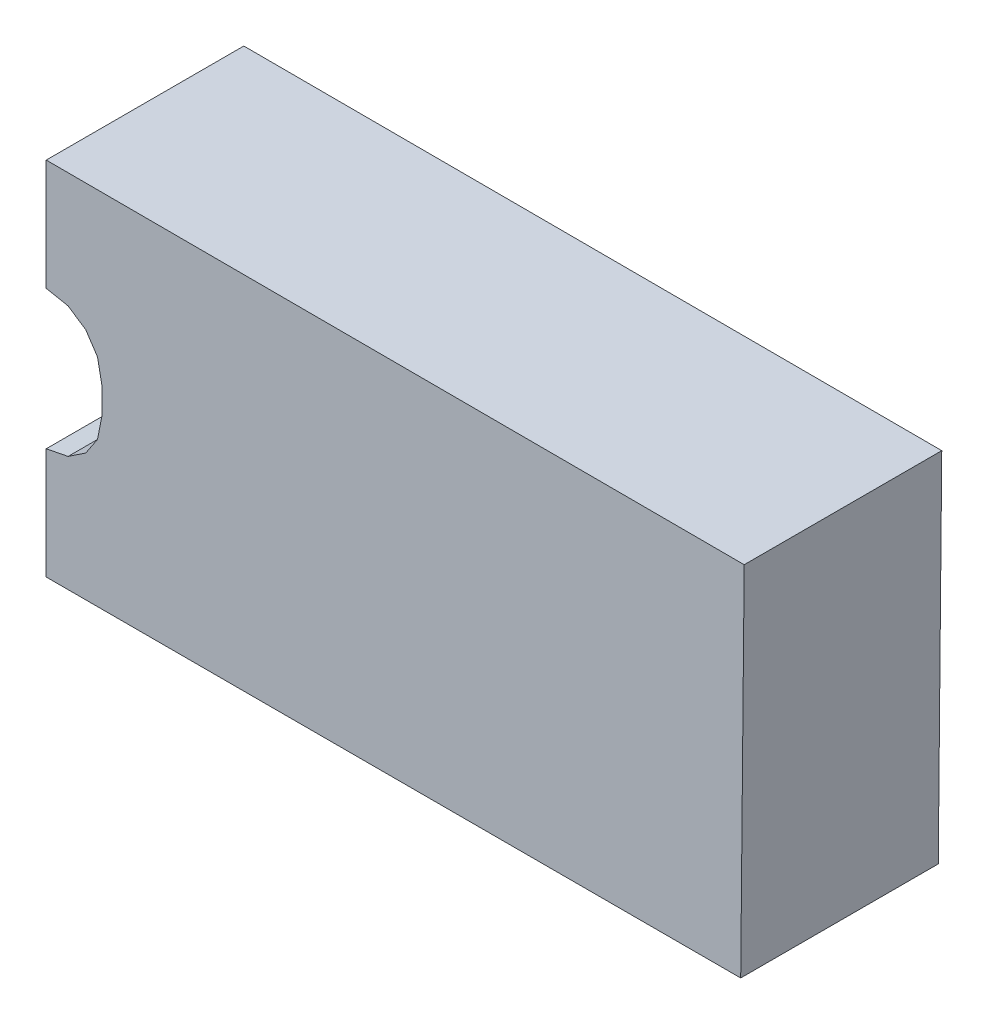
ISO-10303-21;
HEADER;
FILE_DESCRIPTION(('STEP AP214'),'2;1');
FILE_NAME('part.step','',(''),(''),'','','');
FILE_SCHEMA(('AUTOMOTIVE_DESIGN { 1 0 10303 214 1 1 1 1 }'));
ENDSEC;
DATA;
#1=APPLICATION_CONTEXT('core data for automotive mechanical design processes');
#2=APPLICATION_PROTOCOL_DEFINITION('international standard','automotive_design',2000,#1);
#3=PRODUCT_CONTEXT('',#1,'mechanical');
#4=PRODUCT('Part','Part','',(#3));
#5=PRODUCT_RELATED_PRODUCT_CATEGORY('part','',(#4));
#6=PRODUCT_DEFINITION_FORMATION('','',#4);
#7=PRODUCT_DEFINITION_CONTEXT('part definition',#1,'design');
#8=PRODUCT_DEFINITION('design','',#6,#7);
#9=PRODUCT_DEFINITION_SHAPE('','',#8);
#10=(LENGTH_UNIT() NAMED_UNIT(*) SI_UNIT(.MILLI.,.METRE.));
#11=(NAMED_UNIT(*) PLANE_ANGLE_UNIT() SI_UNIT($,.RADIAN.));
#12=(NAMED_UNIT(*) SI_UNIT($,.STERADIAN.) SOLID_ANGLE_UNIT());
#13=UNCERTAINTY_MEASURE_WITH_UNIT(LENGTH_MEASURE(1.E-05),#10,'distance_accuracy_value','');
#14=(GEOMETRIC_REPRESENTATION_CONTEXT(3) GLOBAL_UNCERTAINTY_ASSIGNED_CONTEXT((#13)) GLOBAL_UNIT_ASSIGNED_CONTEXT((#10,
#11,#12)) REPRESENTATION_CONTEXT('',''));
#15=CARTESIAN_POINT('',(0.,0.,0.));
#16=DIRECTION('',(0.,0.,1.));
#17=DIRECTION('',(1.,0.,0.));
#18=AXIS2_PLACEMENT_3D('',#15,#16,#17);
#19=CARTESIAN_POINT('',(-1.275,0.65,0.762));
#20=DIRECTION('',(0.,0.,-1.));
#21=DIRECTION('',(-1.,0.,0.));
#22=AXIS2_PLACEMENT_3D('',#19,#20,#21);
#23=PLANE('',#22);
#24=DIRECTION('',(-0.831687303808584,0.55524429639899,0.));
#25=VECTOR('',#24,1.);
#26=CARTESIAN_POINT('',(-1.13281,0.19219,0.762));
#27=LINE('',#26,#25);
#28=CARTESIAN_POINT('',(-1.13281,0.192190000000004,0.762));
#29=VERTEX_POINT('',#28);
#30=CARTESIAN_POINT('',(-1.19629,0.234569999999999,0.762));
#31=VERTEX_POINT('',#30);
#32=EDGE_CURVE('E150',#29,#31,#27,.T.);
#33=ORIENTED_EDGE('',*,*,#32,.F.);
#34=DIRECTION('',(-0.555244296398989,0.831687303808584,0.));
#35=VECTOR('',#34,1.);
#36=CARTESIAN_POINT('',(-1.09043,0.12871,0.762));
#37=LINE('',#36,#35);
#38=CARTESIAN_POINT('',(-1.09043,0.128709999999998,0.762));
#39=VERTEX_POINT('',#38);
#40=EDGE_CURVE('E148',#39,#29,#37,.T.);
#41=ORIENTED_EDGE('',*,*,#40,.F.);
#42=DIRECTION('',(-0.192374440664852,0.981321595899573,0.));
#43=VECTOR('',#42,1.);
#44=CARTESIAN_POINT('',(-1.075,0.05,0.762));
#45=LINE('',#44,#43);
#46=CARTESIAN_POINT('',(-1.075,0.0500000000000029,0.762));
#47=VERTEX_POINT('',#46);
#48=EDGE_CURVE('E146',#47,#39,#45,.T.);
#49=ORIENTED_EDGE('',*,*,#48,.F.);
#50=DIRECTION('',(0.,1.,0.));
#51=VECTOR('',#50,1.);
#52=CARTESIAN_POINT('',(-1.075,0.65,0.762));
#53=LINE('',#52,#51);
#54=CARTESIAN_POINT('',(-1.075,-0.0500000000000004,0.762));
#55=VERTEX_POINT('',#54);
#56=EDGE_CURVE('E144',#55,#47,#53,.T.);
#57=ORIENTED_EDGE('',*,*,#56,.F.);
#58=DIRECTION('',(0.192374440664852,0.981321595899573,0.));
#59=VECTOR('',#58,1.);
#60=CARTESIAN_POINT('',(-1.09043,-0.12871,0.762));
#61=LINE('',#60,#59);
#62=CARTESIAN_POINT('',(-1.09043,-0.12871,0.762));
#63=VERTEX_POINT('',#62);
#64=EDGE_CURVE('E142',#63,#55,#61,.T.);
#65=ORIENTED_EDGE('',*,*,#64,.F.);
#66=DIRECTION('',(0.555244296398989,0.831687303808584,0.));
#67=VECTOR('',#66,1.);
#68=CARTESIAN_POINT('',(-1.13281,-0.19219,0.762));
#69=LINE('',#68,#67);
#70=CARTESIAN_POINT('',(-1.13281,-0.192190000000002,0.762));
#71=VERTEX_POINT('',#70);
#72=EDGE_CURVE('E138',#71,#63,#69,.T.);
#73=ORIENTED_EDGE('',*,*,#72,.F.);
#74=DIRECTION('',(0.831687303808583,0.55524429639899,0.));
#75=VECTOR('',#74,1.);
#76=CARTESIAN_POINT('',(-1.19629,-0.23457,0.762));
#77=LINE('',#76,#75);
#78=CARTESIAN_POINT('',(-1.19629,-0.234569999999996,0.762));
#79=VERTEX_POINT('',#78);
#80=EDGE_CURVE('E137',#79,#71,#77,.T.);
#81=ORIENTED_EDGE('',*,*,#80,.F.);
#82=DIRECTION('',(0.981321595899573,0.192374440664851,0.));
#83=VECTOR('',#82,1.);
#84=CARTESIAN_POINT('',(-1.275,-0.25,0.762));
#85=LINE('',#84,#83);
#86=CARTESIAN_POINT('',(-1.275,-0.250000000000001,0.762));
#87=VERTEX_POINT('',#86);
#88=EDGE_CURVE('E115',#87,#79,#85,.T.);
#89=ORIENTED_EDGE('',*,*,#88,.F.);
#90=DIRECTION('',(0.,1.,0.));
#91=VECTOR('',#90,1.);
#92=CARTESIAN_POINT('',(-1.275,0.65,0.762));
#93=LINE('',#92,#91);
#94=CARTESIAN_POINT('',(-1.275,-0.65,0.762));
#95=VERTEX_POINT('',#94);
#96=EDGE_CURVE('E20',#95,#87,#93,.T.);
#97=ORIENTED_EDGE('',*,*,#96,.F.);
#98=DIRECTION('',(1.,0.,0.));
#99=VECTOR('',#98,1.);
#100=CARTESIAN_POINT('',(-1.275,-0.65,0.762));
#101=LINE('',#100,#99);
#102=CARTESIAN_POINT('',(1.225,-0.65,0.762));
#103=VERTEX_POINT('',#102);
#104=EDGE_CURVE('E169',#95,#103,#101,.T.);
#105=ORIENTED_EDGE('',*,*,#104,.T.);
#106=DIRECTION('',(-0.00973077189679958,-0.999952654918368,0.));
#107=VECTOR('',#106,1.);
#108=CARTESIAN_POINT('',(1.225,-0.65,0.762));
#109=LINE('',#108,#107);
#110=CARTESIAN_POINT('',(1.2376,0.6448,0.762));
#111=VERTEX_POINT('',#110);
#112=EDGE_CURVE('E164',#103,#111,#109,.F.);
#113=ORIENTED_EDGE('',*,*,#112,.T.);
#114=DIRECTION('',(0.99999785844819,-0.00206956493828339,0.));
#115=VECTOR('',#114,1.);
#116=CARTESIAN_POINT('',(1.2376,0.6448,0.762));
#117=LINE('',#116,#115);
#118=CARTESIAN_POINT('',(-1.275,0.65,0.762));
#119=VERTEX_POINT('',#118);
#120=EDGE_CURVE('E159',#111,#119,#117,.F.);
#121=ORIENTED_EDGE('',*,*,#120,.T.);
#122=DIRECTION('',(0.,1.,0.));
#123=VECTOR('',#122,1.);
#124=CARTESIAN_POINT('',(-1.275,0.65,0.762));
#125=LINE('',#124,#123);
#126=CARTESIAN_POINT('',(-1.275,0.25,0.762));
#127=VERTEX_POINT('',#126);
#128=EDGE_CURVE('E154',#119,#127,#125,.F.);
#129=ORIENTED_EDGE('',*,*,#128,.T.);
#130=DIRECTION('',(-0.981321595899573,0.192374440664851,0.));
#131=VECTOR('',#130,1.);
#132=CARTESIAN_POINT('',(-1.19629,0.23457,0.762));
#133=LINE('',#132,#131);
#134=EDGE_CURVE('E152',#31,#127,#133,.T.);
#135=ORIENTED_EDGE('',*,*,#134,.F.);
#136=EDGE_LOOP('',(#33,#41,#49,#57,#65,#73,#81,#89,#97,#105,#113,#121,#129,#135));
#137=FACE_BOUND('',#136,.T.);
#138=ADVANCED_FACE('F17',(#137),#23,.F.);
#139=CARTESIAN_POINT('',(-1.275,0.65,0.0508));
#140=DIRECTION('',(1.,0.,0.));
#141=DIRECTION('',(0.,0.,-1.));
#142=AXIS2_PLACEMENT_3D('',#139,#140,#141);
#143=PLANE('',#142);
#144=DIRECTION('',(0.,0.,1.));
#145=VECTOR('',#144,1.);
#146=CARTESIAN_POINT('',(-1.275,0.65,0.0508));
#147=LINE('',#146,#145);
#148=CARTESIAN_POINT('',(-1.275,0.65,0.0508));
#149=VERTEX_POINT('',#148);
#150=EDGE_CURVE('E157',#119,#149,#147,.F.);
#151=ORIENTED_EDGE('',*,*,#150,.T.);
#152=DIRECTION('',(0.,1.,0.));
#153=VECTOR('',#152,1.);
#154=CARTESIAN_POINT('',(-1.275,0.65,0.0508));
#155=LINE('',#154,#153);
#156=CARTESIAN_POINT('',(-1.275,0.25,0.0508));
#157=VERTEX_POINT('',#156);
#158=EDGE_CURVE('E189',#157,#149,#155,.T.);
#159=ORIENTED_EDGE('',*,*,#158,.F.);
#160=DIRECTION('',(0.,0.,1.));
#161=VECTOR('',#160,1.);
#162=CARTESIAN_POINT('',(-1.275,0.25,0.0508));
#163=LINE('',#162,#161);
#164=EDGE_CURVE('E186',#157,#127,#163,.T.);
#165=ORIENTED_EDGE('',*,*,#164,.T.);
#166=ORIENTED_EDGE('',*,*,#128,.F.);
#167=EDGE_LOOP('',(#151,#159,#165,#166));
#168=FACE_BOUND('',#167,.T.);
#169=ADVANCED_FACE('F236',(#168),#143,.F.);
#170=CARTESIAN_POINT('',(1.2376,0.6448,0.0508));
#171=DIRECTION('',(-0.00206956493828339,-0.99999785844819,0.));
#172=DIRECTION('',(0.99999785844819,-0.00206956493828339,0.));
#173=AXIS2_PLACEMENT_3D('',#170,#171,#172);
#174=PLANE('',#173);
#175=DIRECTION('',(0.,0.,1.));
#176=VECTOR('',#175,1.);
#177=CARTESIAN_POINT('',(1.2376,0.6448,0.0508));
#178=LINE('',#177,#176);
#179=CARTESIAN_POINT('',(1.2376,0.6448,0.0508));
#180=VERTEX_POINT('',#179);
#181=EDGE_CURVE('E162',#111,#180,#178,.F.);
#182=ORIENTED_EDGE('',*,*,#181,.T.);
#183=DIRECTION('',(0.99999785844819,-0.00206956493828329,0.));
#184=VECTOR('',#183,1.);
#185=CARTESIAN_POINT('',(-1.275,0.65,0.0508));
#186=LINE('',#185,#184);
#187=EDGE_CURVE('E192',#149,#180,#186,.T.);
#188=ORIENTED_EDGE('',*,*,#187,.F.);
#189=ORIENTED_EDGE('',*,*,#150,.F.);
#190=ORIENTED_EDGE('',*,*,#120,.F.);
#191=EDGE_LOOP('',(#182,#188,#189,#190));
#192=FACE_BOUND('',#191,.T.);
#193=ADVANCED_FACE('F241',(#192),#174,.F.);
#194=CARTESIAN_POINT('',(1.225,-0.65,0.0508));
#195=DIRECTION('',(-0.999952654918368,0.00973077189679958,0.));
#196=DIRECTION('',(-0.00973077189679958,-0.999952654918368,0.));
#197=AXIS2_PLACEMENT_3D('',#194,#195,#196);
#198=PLANE('',#197);
#199=DIRECTION('',(0.,0.,1.));
#200=VECTOR('',#199,1.);
#201=CARTESIAN_POINT('',(1.225,-0.65,0.0508));
#202=LINE('',#201,#200);
#203=CARTESIAN_POINT('',(1.225,-0.65,0.0508));
#204=VERTEX_POINT('',#203);
#205=EDGE_CURVE('E167',#103,#204,#202,.F.);
#206=ORIENTED_EDGE('',*,*,#205,.T.);
#207=DIRECTION('',(-0.00973077189679613,-0.999952654918368,0.));
#208=VECTOR('',#207,1.);
#209=CARTESIAN_POINT('',(1.2376,0.6448,0.0508));
#210=LINE('',#209,#208);
#211=EDGE_CURVE('E195',#180,#204,#210,.T.);
#212=ORIENTED_EDGE('',*,*,#211,.F.);
#213=ORIENTED_EDGE('',*,*,#181,.F.);
#214=ORIENTED_EDGE('',*,*,#112,.F.);
#215=EDGE_LOOP('',(#206,#212,#213,#214));
#216=FACE_BOUND('',#215,.T.);
#217=ADVANCED_FACE('F244',(#216),#198,.F.);
#218=CARTESIAN_POINT('',(-1.275,-0.65,0.0508));
#219=DIRECTION('',(0.,1.,0.));
#220=DIRECTION('',(0.,0.,1.));
#221=AXIS2_PLACEMENT_3D('',#218,#219,#220);
#222=PLANE('',#221);
#223=DIRECTION('',(0.,0.,-1.));
#224=VECTOR('',#223,1.);
#225=CARTESIAN_POINT('',(-1.275,-0.65,0.0508));
#226=LINE('',#225,#224);
#227=CARTESIAN_POINT('',(-1.275,-0.65,0.0508));
#228=VERTEX_POINT('',#227);
#229=EDGE_CURVE('E124',#95,#228,#226,.T.);
#230=ORIENTED_EDGE('',*,*,#229,.T.);
#231=DIRECTION('',(-1.,0.,0.));
#232=VECTOR('',#231,1.);
#233=CARTESIAN_POINT('',(-1.275,-0.65,0.0508));
#234=LINE('',#233,#232);
#235=EDGE_CURVE('E198',#204,#228,#234,.T.);
#236=ORIENTED_EDGE('',*,*,#235,.F.);
#237=ORIENTED_EDGE('',*,*,#205,.F.);
#238=ORIENTED_EDGE('',*,*,#104,.F.);
#239=EDGE_LOOP('',(#230,#236,#237,#238));
#240=FACE_BOUND('',#239,.T.);
#241=ADVANCED_FACE('F248',(#240),#222,.F.);
#242=CARTESIAN_POINT('',(-1.275,-0.25,0.0508));
#243=DIRECTION('',(1.,0.,0.));
#244=DIRECTION('',(0.,0.,-1.));
#245=AXIS2_PLACEMENT_3D('',#242,#243,#244);
#246=PLANE('',#245);
#247=DIRECTION('',(0.,0.,1.));
#248=VECTOR('',#247,1.);
#249=CARTESIAN_POINT('',(-1.275,-0.250000000000005,0.0508));
#250=LINE('',#249,#248);
#251=CARTESIAN_POINT('',(-1.275,-0.250000000000001,0.0508));
#252=VERTEX_POINT('',#251);
#253=EDGE_CURVE('E122',#87,#252,#250,.F.);
#254=ORIENTED_EDGE('',*,*,#253,.T.);
#255=DIRECTION('',(0.,1.,0.));
#256=VECTOR('',#255,1.);
#257=CARTESIAN_POINT('',(-1.275,0.65,0.0508));
#258=LINE('',#257,#256);
#259=EDGE_CURVE('E201',#228,#252,#258,.T.);
#260=ORIENTED_EDGE('',*,*,#259,.F.);
#261=ORIENTED_EDGE('',*,*,#229,.F.);
#262=ORIENTED_EDGE('',*,*,#96,.T.);
#263=EDGE_LOOP('',(#254,#260,#261,#262));
#264=FACE_BOUND('',#263,.T.);
#265=ADVANCED_FACE('F120',(#264),#246,.F.);
#266=CARTESIAN_POINT('',(-1.19629,-0.23457,0.0508));
#267=DIRECTION('',(0.192374440664914,-0.981321595899561,0.));
#268=DIRECTION('',(0.981321595899561,0.192374440664914,0.));
#269=AXIS2_PLACEMENT_3D('',#266,#267,#268);
#270=PLANE('',#269);
#271=DIRECTION('',(0.,0.,1.));
#272=VECTOR('',#271,1.);
#273=CARTESIAN_POINT('',(-1.19629000000001,-0.234569999999986,0.0508));
#274=LINE('',#273,#272);
#275=CARTESIAN_POINT('',(-1.19629,-0.234569999999996,0.0508));
#276=VERTEX_POINT('',#275);
#277=EDGE_CURVE('E132',#79,#276,#274,.F.);
#278=ORIENTED_EDGE('',*,*,#277,.T.);
#279=DIRECTION('',(0.981321595899573,0.192374440664851,0.));
#280=VECTOR('',#279,1.);
#281=CARTESIAN_POINT('',(-1.275,-0.25,0.0508));
#282=LINE('',#281,#280);
#283=EDGE_CURVE('E130',#252,#276,#282,.T.);
#284=ORIENTED_EDGE('',*,*,#283,.F.);
#285=ORIENTED_EDGE('',*,*,#253,.F.);
#286=ORIENTED_EDGE('',*,*,#88,.T.);
#287=EDGE_LOOP('',(#278,#284,#285,#286));
#288=FACE_BOUND('',#287,.T.);
#289=ADVANCED_FACE('F128',(#288),#270,.F.);
#290=CARTESIAN_POINT('',(-1.13281,-0.19219,0.0508));
#291=DIRECTION('',(0.555244296398804,-0.831687303808707,0.));
#292=DIRECTION('',(0.831687303808707,0.555244296398804,0.));
#293=AXIS2_PLACEMENT_3D('',#290,#291,#292);
#294=PLANE('',#293);
#295=DIRECTION('',(0.,0.,1.));
#296=VECTOR('',#295,1.);
#297=CARTESIAN_POINT('',(-1.13280999999999,-0.192190000000009,0.0508));
#298=LINE('',#297,#296);
#299=CARTESIAN_POINT('',(-1.13281,-0.192190000000002,0.0508));
#300=VERTEX_POINT('',#299);
#301=EDGE_CURVE('E173',#71,#300,#298,.F.);
#302=ORIENTED_EDGE('',*,*,#301,.T.);
#303=DIRECTION('',(0.831687303808583,0.55524429639899,0.));
#304=VECTOR('',#303,1.);
#305=CARTESIAN_POINT('',(-1.19629,-0.23457,0.0508));
#306=LINE('',#305,#304);
#307=EDGE_CURVE('E204',#276,#300,#306,.T.);
#308=ORIENTED_EDGE('',*,*,#307,.F.);
#309=ORIENTED_EDGE('',*,*,#277,.F.);
#310=ORIENTED_EDGE('',*,*,#80,.T.);
#311=EDGE_LOOP('',(#302,#308,#309,#310));
#312=FACE_BOUND('',#311,.T.);
#313=ADVANCED_FACE('F252',(#312),#294,.F.);
#314=CARTESIAN_POINT('',(-1.09043,-0.12871,0.0508));
#315=DIRECTION('',(0.831687303808707,-0.555244296398804,0.));
#316=DIRECTION('',(0.555244296398804,0.831687303808707,0.));
#317=AXIS2_PLACEMENT_3D('',#314,#315,#316);
#318=PLANE('',#317);
#319=DIRECTION('',(0.,0.,1.));
#320=VECTOR('',#319,1.);
#321=CARTESIAN_POINT('',(-1.09043000000001,-0.128709999999999,0.0508));
#322=LINE('',#321,#320);
#323=CARTESIAN_POINT('',(-1.09043,-0.12871,0.0508));
#324=VERTEX_POINT('',#323);
#325=EDGE_CURVE('E175',#63,#324,#322,.F.);
#326=ORIENTED_EDGE('',*,*,#325,.T.);
#327=DIRECTION('',(0.555244296398989,0.831687303808584,0.));
#328=VECTOR('',#327,1.);
#329=CARTESIAN_POINT('',(-1.13281,-0.19219,0.0508));
#330=LINE('',#329,#328);
#331=EDGE_CURVE('E207',#300,#324,#330,.T.);
#332=ORIENTED_EDGE('',*,*,#331,.F.);
#333=ORIENTED_EDGE('',*,*,#301,.F.);
#334=ORIENTED_EDGE('',*,*,#72,.T.);
#335=EDGE_LOOP('',(#326,#332,#333,#334));
#336=FACE_BOUND('',#335,.T.);
#337=ADVANCED_FACE('F255',(#336),#318,.F.);
#338=CARTESIAN_POINT('',(-1.075,-0.05,0.0508));
#339=DIRECTION('',(0.981321595899561,-0.192374440664914,0.));
#340=DIRECTION('',(0.192374440664914,0.981321595899561,0.));
#341=AXIS2_PLACEMENT_3D('',#338,#339,#340);
#342=PLANE('',#341);
#343=DIRECTION('',(0.,0.,-1.));
#344=VECTOR('',#343,1.);
#345=CARTESIAN_POINT('',(-1.075,-0.05,0.0508));
#346=LINE('',#345,#344);
#347=CARTESIAN_POINT('',(-1.075,-0.0500000000000002,0.0508));
#348=VERTEX_POINT('',#347);
#349=EDGE_CURVE('E177',#55,#348,#346,.T.);
#350=ORIENTED_EDGE('',*,*,#349,.T.);
#351=DIRECTION('',(0.192374440664852,0.981321595899573,0.));
#352=VECTOR('',#351,1.);
#353=CARTESIAN_POINT('',(-1.09043,-0.12871,0.0508));
#354=LINE('',#353,#352);
#355=EDGE_CURVE('E210',#324,#348,#354,.T.);
#356=ORIENTED_EDGE('',*,*,#355,.F.);
#357=ORIENTED_EDGE('',*,*,#325,.F.);
#358=ORIENTED_EDGE('',*,*,#64,.T.);
#359=EDGE_LOOP('',(#350,#356,#357,#358));
#360=FACE_BOUND('',#359,.T.);
#361=ADVANCED_FACE('F260',(#360),#342,.F.);
#362=CARTESIAN_POINT('',(-1.075,0.05,0.0508));
#363=DIRECTION('',(1.,0.,0.));
#364=DIRECTION('',(0.,0.,-1.));
#365=AXIS2_PLACEMENT_3D('',#362,#363,#364);
#366=PLANE('',#365);
#367=DIRECTION('',(0.,0.,1.));
#368=VECTOR('',#367,1.);
#369=CARTESIAN_POINT('',(-1.075,0.050000000000001,0.0508));
#370=LINE('',#369,#368);
#371=CARTESIAN_POINT('',(-1.075,0.0500000000000016,0.0508));
#372=VERTEX_POINT('',#371);
#373=EDGE_CURVE('E179',#47,#372,#370,.F.);
#374=ORIENTED_EDGE('',*,*,#373,.T.);
#375=DIRECTION('',(0.,1.,0.));
#376=VECTOR('',#375,1.);
#377=CARTESIAN_POINT('',(-1.075,0.65,0.0508));
#378=LINE('',#377,#376);
#379=EDGE_CURVE('E213',#348,#372,#378,.T.);
#380=ORIENTED_EDGE('',*,*,#379,.F.);
#381=ORIENTED_EDGE('',*,*,#349,.F.);
#382=ORIENTED_EDGE('',*,*,#56,.T.);
#383=EDGE_LOOP('',(#374,#380,#381,#382));
#384=FACE_BOUND('',#383,.T.);
#385=ADVANCED_FACE('F265',(#384),#366,.F.);
#386=CARTESIAN_POINT('',(-1.09043,0.12871,0.0508));
#387=DIRECTION('',(0.981321595899561,0.192374440664914,0.));
#388=DIRECTION('',(-0.192374440664914,0.981321595899561,0.));
#389=AXIS2_PLACEMENT_3D('',#386,#387,#388);
#390=PLANE('',#389);
#391=DIRECTION('',(0.,0.,1.));
#392=VECTOR('',#391,1.);
#393=CARTESIAN_POINT('',(-1.09043000000001,0.128709999999991,0.0508));
#394=LINE('',#393,#392);
#395=CARTESIAN_POINT('',(-1.09043,0.128709999999998,0.0508));
#396=VERTEX_POINT('',#395);
#397=EDGE_CURVE('E181',#39,#396,#394,.F.);
#398=ORIENTED_EDGE('',*,*,#397,.T.);
#399=DIRECTION('',(-0.192374440664852,0.981321595899573,0.));
#400=VECTOR('',#399,1.);
#401=CARTESIAN_POINT('',(-1.075,0.05,0.0508));
#402=LINE('',#401,#400);
#403=EDGE_CURVE('E216',#372,#396,#402,.T.);
#404=ORIENTED_EDGE('',*,*,#403,.F.);
#405=ORIENTED_EDGE('',*,*,#373,.F.);
#406=ORIENTED_EDGE('',*,*,#48,.T.);
#407=EDGE_LOOP('',(#398,#404,#405,#406));
#408=FACE_BOUND('',#407,.T.);
#409=ADVANCED_FACE('F269',(#408),#390,.F.);
#410=CARTESIAN_POINT('',(-1.13281,0.19219,0.0508));
#411=DIRECTION('',(0.831687303808707,0.555244296398804,0.));
#412=DIRECTION('',(-0.555244296398804,0.831687303808707,0.));
#413=AXIS2_PLACEMENT_3D('',#410,#411,#412);
#414=PLANE('',#413);
#415=DIRECTION('',(0.,0.,1.));
#416=VECTOR('',#415,1.);
#417=CARTESIAN_POINT('',(-1.13280999999999,0.192190000000014,0.0508));
#418=LINE('',#417,#416);
#419=CARTESIAN_POINT('',(-1.13281,0.192190000000004,0.0508));
#420=VERTEX_POINT('',#419);
#421=EDGE_CURVE('E183',#29,#420,#418,.F.);
#422=ORIENTED_EDGE('',*,*,#421,.T.);
#423=DIRECTION('',(-0.555244296398989,0.831687303808584,0.));
#424=VECTOR('',#423,1.);
#425=CARTESIAN_POINT('',(-1.09043,0.12871,0.0508));
#426=LINE('',#425,#424);
#427=EDGE_CURVE('E219',#396,#420,#426,.T.);
#428=ORIENTED_EDGE('',*,*,#427,.F.);
#429=ORIENTED_EDGE('',*,*,#397,.F.);
#430=ORIENTED_EDGE('',*,*,#40,.T.);
#431=EDGE_LOOP('',(#422,#428,#429,#430));
#432=FACE_BOUND('',#431,.T.);
#433=ADVANCED_FACE('F271',(#432),#414,.F.);
#434=CARTESIAN_POINT('',(-1.19629,0.23457,0.0508));
#435=DIRECTION('',(0.555244296398804,0.831687303808707,0.));
#436=DIRECTION('',(-0.831687303808707,0.555244296398804,0.));
#437=AXIS2_PLACEMENT_3D('',#434,#435,#436);
#438=PLANE('',#437);
#439=DIRECTION('',(0.,0.,1.));
#440=VECTOR('',#439,1.);
#441=CARTESIAN_POINT('',(-1.19629,0.234569999999995,0.0508));
#442=LINE('',#441,#440);
#443=CARTESIAN_POINT('',(-1.19629,0.234569999999999,0.0508));
#444=VERTEX_POINT('',#443);
#445=EDGE_CURVE('E35',#31,#444,#442,.F.);
#446=ORIENTED_EDGE('',*,*,#445,.T.);
#447=DIRECTION('',(-0.831687303808584,0.55524429639899,0.));
#448=VECTOR('',#447,1.);
#449=CARTESIAN_POINT('',(-1.13281,0.19219,0.0508));
#450=LINE('',#449,#448);
#451=EDGE_CURVE('E26',#420,#444,#450,.T.);
#452=ORIENTED_EDGE('',*,*,#451,.F.);
#453=ORIENTED_EDGE('',*,*,#421,.F.);
#454=ORIENTED_EDGE('',*,*,#32,.T.);
#455=EDGE_LOOP('',(#446,#452,#453,#454));
#456=FACE_BOUND('',#455,.T.);
#457=ADVANCED_FACE('F227',(#456),#438,.F.);
#458=CARTESIAN_POINT('',(-1.275,0.25,0.0508));
#459=DIRECTION('',(0.192374440664914,0.981321595899561,0.));
#460=DIRECTION('',(-0.981321595899561,0.192374440664914,0.));
#461=AXIS2_PLACEMENT_3D('',#458,#459,#460);
#462=PLANE('',#461);
#463=ORIENTED_EDGE('',*,*,#164,.F.);
#464=DIRECTION('',(-0.981321595899573,0.192374440664851,0.));
#465=VECTOR('',#464,1.);
#466=CARTESIAN_POINT('',(-1.19629,0.23457,0.0508));
#467=LINE('',#466,#465);
#468=EDGE_CURVE('E11',#444,#157,#467,.T.);
#469=ORIENTED_EDGE('',*,*,#468,.F.);
#470=ORIENTED_EDGE('',*,*,#445,.F.);
#471=ORIENTED_EDGE('',*,*,#134,.T.);
#472=EDGE_LOOP('',(#463,#469,#470,#471));
#473=FACE_BOUND('',#472,.T.);
#474=ADVANCED_FACE('F234',(#473),#462,.F.);
#475=CARTESIAN_POINT('',(-1.275,0.65,0.0508));
#476=DIRECTION('',(0.,0.,-1.));
#477=DIRECTION('',(-1.,0.,0.));
#478=AXIS2_PLACEMENT_3D('',#475,#476,#477);
#479=PLANE('',#478);
#480=ORIENTED_EDGE('',*,*,#451,.T.);
#481=ORIENTED_EDGE('',*,*,#468,.T.);
#482=ORIENTED_EDGE('',*,*,#158,.T.);
#483=ORIENTED_EDGE('',*,*,#187,.T.);
#484=ORIENTED_EDGE('',*,*,#211,.T.);
#485=ORIENTED_EDGE('',*,*,#235,.T.);
#486=ORIENTED_EDGE('',*,*,#259,.T.);
#487=ORIENTED_EDGE('',*,*,#283,.T.);
#488=ORIENTED_EDGE('',*,*,#307,.T.);
#489=ORIENTED_EDGE('',*,*,#331,.T.);
#490=ORIENTED_EDGE('',*,*,#355,.T.);
#491=ORIENTED_EDGE('',*,*,#379,.T.);
#492=ORIENTED_EDGE('',*,*,#403,.T.);
#493=ORIENTED_EDGE('',*,*,#427,.T.);
#494=EDGE_LOOP('',(#480,#481,#482,#483,#484,#485,#486,#487,#488,#489,#490,#491,#492,#493));
#495=FACE_BOUND('',#494,.T.);
#496=ADVANCED_FACE('F224',(#495),#479,.T.);
#497=CLOSED_SHELL('',(#138,#169,#193,#217,#241,#265,#289,#313,#337,#361,#385,#409,#433,#457,
#474,#496));
#498=MANIFOLD_SOLID_BREP('B1',#497);
#499=ADVANCED_BREP_SHAPE_REPRESENTATION('',(#18,#498),#14);
#500=SHAPE_DEFINITION_REPRESENTATION(#9,#499);
ENDSEC;
END-ISO-10303-21;
